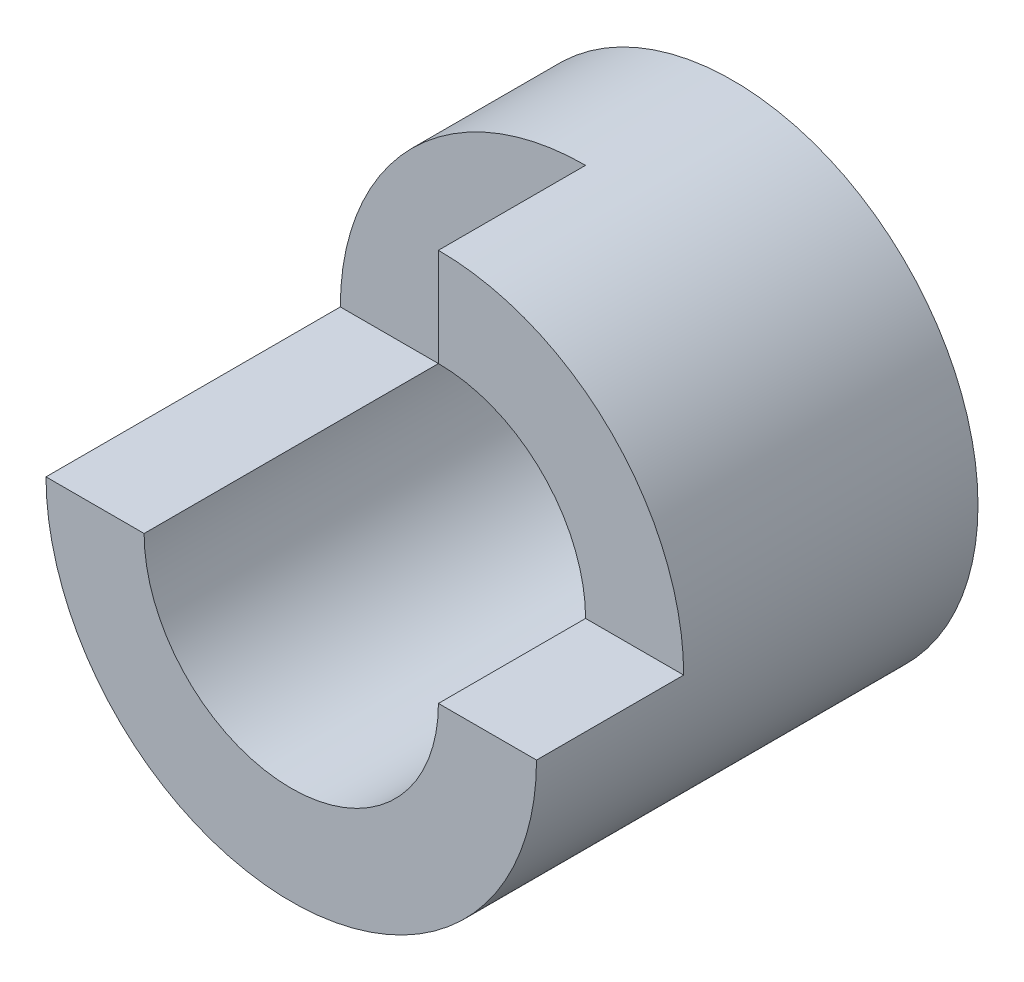
ISO-10303-21;
HEADER;
FILE_DESCRIPTION(('STEP AP214'),'2;1');
FILE_NAME('part.step','',(''),(''),'','','');
FILE_SCHEMA(('AUTOMOTIVE_DESIGN { 1 0 10303 214 1 1 1 1 }'));
ENDSEC;
DATA;
#1=APPLICATION_CONTEXT('core data for automotive mechanical design processes');
#2=APPLICATION_PROTOCOL_DEFINITION('international standard','automotive_design',2000,#1);
#3=PRODUCT_CONTEXT('',#1,'mechanical');
#4=PRODUCT('Part','Part','',(#3));
#5=PRODUCT_RELATED_PRODUCT_CATEGORY('part','',(#4));
#6=PRODUCT_DEFINITION_FORMATION('','',#4);
#7=PRODUCT_DEFINITION_CONTEXT('part definition',#1,'design');
#8=PRODUCT_DEFINITION('design','',#6,#7);
#9=PRODUCT_DEFINITION_SHAPE('','',#8);
#10=(LENGTH_UNIT() NAMED_UNIT(*) SI_UNIT(.MILLI.,.METRE.));
#11=(NAMED_UNIT(*) PLANE_ANGLE_UNIT() SI_UNIT($,.RADIAN.));
#12=(NAMED_UNIT(*) SI_UNIT($,.STERADIAN.) SOLID_ANGLE_UNIT());
#13=UNCERTAINTY_MEASURE_WITH_UNIT(LENGTH_MEASURE(1.E-05),#10,'distance_accuracy_value','');
#14=(GEOMETRIC_REPRESENTATION_CONTEXT(3) GLOBAL_UNCERTAINTY_ASSIGNED_CONTEXT((#13)) GLOBAL_UNIT_ASSIGNED_CONTEXT((#10,
#11,#12)) REPRESENTATION_CONTEXT('',''));
#15=CARTESIAN_POINT('',(0.,0.,0.));
#16=DIRECTION('',(0.,0.,1.));
#17=DIRECTION('',(1.,0.,0.));
#18=AXIS2_PLACEMENT_3D('',#15,#16,#17);
#19=CARTESIAN_POINT('',(0.,0.,9.));
#20=DIRECTION('',(0.,0.,1.));
#21=DIRECTION('',(1.,0.,0.));
#22=AXIS2_PLACEMENT_3D('',#19,#20,#21);
#23=PLANE('',#22);
#24=CARTESIAN_POINT('',(0.,0.,9.));
#25=DIRECTION('',(0.,0.,1.));
#26=DIRECTION('',(1.,0.,0.));
#27=AXIS2_PLACEMENT_3D('',#24,#25,#26);
#28=CIRCLE('',#27,5.);
#29=CARTESIAN_POINT('',(-5.,0.,9.));
#30=VERTEX_POINT('',#29);
#31=CARTESIAN_POINT('',(5.,0.,9.));
#32=VERTEX_POINT('',#31);
#33=EDGE_CURVE('E110',#30,#32,#28,.T.);
#34=ORIENTED_EDGE('',*,*,#33,.T.);
#35=DIRECTION('',(-1.,0.,0.));
#36=VECTOR('',#35,1.);
#37=CARTESIAN_POINT('',(0.,0.,9.));
#38=LINE('',#37,#36);
#39=CARTESIAN_POINT('',(3.,0.,9.));
#40=VERTEX_POINT('',#39);
#41=EDGE_CURVE('E111',#32,#40,#38,.T.);
#42=ORIENTED_EDGE('',*,*,#41,.T.);
#43=CARTESIAN_POINT('',(0.,0.,9.));
#44=DIRECTION('',(0.,0.,1.));
#45=DIRECTION('',(1.,0.,0.));
#46=AXIS2_PLACEMENT_3D('',#43,#44,#45);
#47=CIRCLE('',#46,3.);
#48=CARTESIAN_POINT('',(-3.,0.,9.));
#49=VERTEX_POINT('',#48);
#50=EDGE_CURVE('E123',#49,#40,#47,.T.);
#51=ORIENTED_EDGE('',*,*,#50,.F.);
#52=EDGE_CURVE('E48',#49,#30,#38,.T.);
#53=ORIENTED_EDGE('',*,*,#52,.T.);
#54=EDGE_LOOP('',(#34,#42,#51,#53));
#55=FACE_BOUND('',#54,.T.);
#56=ADVANCED_FACE('F33',(#55),#23,.T.);
#57=CARTESIAN_POINT('',(0.,0.,9.));
#58=DIRECTION('',(0.,0.,-1.));
#59=DIRECTION('',(-1.,0.,0.));
#60=AXIS2_PLACEMENT_3D('',#57,#58,#59);
#61=CYLINDRICAL_SURFACE('',#60,5.);
#62=DIRECTION('',(0.,0.,-1.));
#63=VECTOR('',#62,1.);
#64=CARTESIAN_POINT('',(-5.,0.,9.));
#65=LINE('',#64,#63);
#66=CARTESIAN_POINT('',(-5.,0.,3.));
#67=VERTEX_POINT('',#66);
#68=EDGE_CURVE('E102',#67,#30,#65,.F.);
#69=ORIENTED_EDGE('',*,*,#68,.F.);
#70=CARTESIAN_POINT('',(0.,0.,3.));
#71=DIRECTION('',(0.,0.,1.));
#72=DIRECTION('',(1.,0.,0.));
#73=AXIS2_PLACEMENT_3D('',#70,#71,#72);
#74=CIRCLE('',#73,5.);
#75=CARTESIAN_POINT('',(0.,5.,3.));
#76=VERTEX_POINT('',#75);
#77=EDGE_CURVE('E89',#76,#67,#74,.T.);
#78=ORIENTED_EDGE('',*,*,#77,.F.);
#79=DIRECTION('',(0.,0.,-1.));
#80=VECTOR('',#79,1.);
#81=CARTESIAN_POINT('',(0.,5.,9.));
#82=LINE('',#81,#80);
#83=CARTESIAN_POINT('',(0.,5.,6.));
#84=VERTEX_POINT('',#83);
#85=EDGE_CURVE('E98',#84,#76,#82,.T.);
#86=ORIENTED_EDGE('',*,*,#85,.F.);
#87=CARTESIAN_POINT('',(0.,0.,6.));
#88=DIRECTION('',(0.,0.,1.));
#89=DIRECTION('',(1.,0.,0.));
#90=AXIS2_PLACEMENT_3D('',#87,#88,#89);
#91=CIRCLE('',#90,5.);
#92=CARTESIAN_POINT('',(5.,0.,6.));
#93=VERTEX_POINT('',#92);
#94=EDGE_CURVE('E120',#93,#84,#91,.T.);
#95=ORIENTED_EDGE('',*,*,#94,.F.);
#96=DIRECTION('',(0.,0.,-1.));
#97=VECTOR('',#96,1.);
#98=CARTESIAN_POINT('',(5.,0.,9.));
#99=LINE('',#98,#97);
#100=EDGE_CURVE('E99',#32,#93,#99,.T.);
#101=ORIENTED_EDGE('',*,*,#100,.F.);
#102=ORIENTED_EDGE('',*,*,#33,.F.);
#103=EDGE_LOOP('',(#69,#78,#86,#95,#101,#102));
#104=FACE_BOUND('',#103,.T.);
#105=CARTESIAN_POINT('',(0.,0.,0.));
#106=DIRECTION('',(0.,0.,1.));
#107=DIRECTION('',(1.,0.,0.));
#108=AXIS2_PLACEMENT_3D('',#105,#106,#107);
#109=CIRCLE('',#108,5.);
#110=CARTESIAN_POINT('',(5.,0.,0.));
#111=VERTEX_POINT('',#110);
#112=EDGE_CURVE('E126',#111,#111,#109,.T.);
#113=ORIENTED_EDGE('',*,*,#112,.T.);
#114=EDGE_LOOP('',(#113));
#115=FACE_BOUND('',#114,.T.);
#116=ADVANCED_FACE('F35',(#104,#115),#61,.T.);
#117=CARTESIAN_POINT('',(0.,0.,9.));
#118=DIRECTION('',(0.,0.,-1.));
#119=DIRECTION('',(-1.,0.,0.));
#120=AXIS2_PLACEMENT_3D('',#117,#118,#119);
#121=CYLINDRICAL_SURFACE('',#120,3.);
#122=CARTESIAN_POINT('',(0.,0.,0.));
#123=DIRECTION('',(0.,0.,1.));
#124=DIRECTION('',(1.,0.,0.));
#125=AXIS2_PLACEMENT_3D('',#122,#123,#124);
#126=CIRCLE('',#125,3.);
#127=CARTESIAN_POINT('',(3.,0.,0.));
#128=VERTEX_POINT('',#127);
#129=EDGE_CURVE('E122',#128,#128,#126,.T.);
#130=ORIENTED_EDGE('',*,*,#129,.F.);
#131=EDGE_LOOP('',(#130));
#132=FACE_BOUND('',#131,.T.);
#133=ORIENTED_EDGE('',*,*,#50,.T.);
#134=DIRECTION('',(0.,0.,-1.));
#135=VECTOR('',#134,1.);
#136=CARTESIAN_POINT('',(3.,0.,9.));
#137=LINE('',#136,#135);
#138=CARTESIAN_POINT('',(3.,0.,6.));
#139=VERTEX_POINT('',#138);
#140=EDGE_CURVE('E11',#40,#139,#137,.T.);
#141=ORIENTED_EDGE('',*,*,#140,.T.);
#142=CARTESIAN_POINT('',(0.,0.,6.));
#143=DIRECTION('',(0.,0.,1.));
#144=DIRECTION('',(1.,0.,0.));
#145=AXIS2_PLACEMENT_3D('',#142,#143,#144);
#146=CIRCLE('',#145,3.);
#147=CARTESIAN_POINT('',(0.,3.,6.));
#148=VERTEX_POINT('',#147);
#149=EDGE_CURVE('E41',#139,#148,#146,.T.);
#150=ORIENTED_EDGE('',*,*,#149,.T.);
#151=DIRECTION('',(0.,0.,-1.));
#152=VECTOR('',#151,1.);
#153=CARTESIAN_POINT('',(0.,3.,9.));
#154=LINE('',#153,#152);
#155=CARTESIAN_POINT('',(0.,3.,3.));
#156=VERTEX_POINT('',#155);
#157=EDGE_CURVE('E56',#148,#156,#154,.T.);
#158=ORIENTED_EDGE('',*,*,#157,.T.);
#159=CARTESIAN_POINT('',(0.,0.,3.));
#160=DIRECTION('',(0.,0.,1.));
#161=DIRECTION('',(1.,0.,0.));
#162=AXIS2_PLACEMENT_3D('',#159,#160,#161);
#163=CIRCLE('',#162,3.);
#164=CARTESIAN_POINT('',(-3.,0.,3.));
#165=VERTEX_POINT('',#164);
#166=EDGE_CURVE('E133',#156,#165,#163,.T.);
#167=ORIENTED_EDGE('',*,*,#166,.T.);
#168=DIRECTION('',(0.,0.,-1.));
#169=VECTOR('',#168,1.);
#170=CARTESIAN_POINT('',(-3.,0.,9.));
#171=LINE('',#170,#169);
#172=EDGE_CURVE('E103',#165,#49,#171,.F.);
#173=ORIENTED_EDGE('',*,*,#172,.T.);
#174=EDGE_LOOP('',(#133,#141,#150,#158,#167,#173));
#175=FACE_BOUND('',#174,.T.);
#176=ADVANCED_FACE('F137',(#132,#175),#121,.F.);
#177=CARTESIAN_POINT('',(0.,0.,0.));
#178=DIRECTION('',(0.,0.,1.));
#179=DIRECTION('',(1.,0.,0.));
#180=AXIS2_PLACEMENT_3D('',#177,#178,#179);
#181=PLANE('',#180);
#182=ORIENTED_EDGE('',*,*,#112,.F.);
#183=EDGE_LOOP('',(#182));
#184=FACE_BOUND('',#183,.T.);
#185=ORIENTED_EDGE('',*,*,#129,.T.);
#186=EDGE_LOOP('',(#185));
#187=FACE_BOUND('',#186,.T.);
#188=ADVANCED_FACE('F157',(#184,#187),#181,.F.);
#189=CARTESIAN_POINT('',(0.,9.,6.));
#190=DIRECTION('',(0.,0.,1.));
#191=DIRECTION('',(1.,0.,0.));
#192=AXIS2_PLACEMENT_3D('',#189,#190,#191);
#193=PLANE('',#192);
#194=ORIENTED_EDGE('',*,*,#94,.T.);
#195=DIRECTION('',(0.,-1.,0.));
#196=VECTOR('',#195,1.);
#197=CARTESIAN_POINT('',(0.,9.,6.));
#198=LINE('',#197,#196);
#199=EDGE_CURVE('E115',#84,#148,#198,.T.);
#200=ORIENTED_EDGE('',*,*,#199,.T.);
#201=ORIENTED_EDGE('',*,*,#149,.F.);
#202=DIRECTION('',(-1.,0.,0.));
#203=VECTOR('',#202,1.);
#204=CARTESIAN_POINT('',(0.,0.,6.));
#205=LINE('',#204,#203);
#206=EDGE_CURVE('E104',#93,#139,#205,.T.);
#207=ORIENTED_EDGE('',*,*,#206,.F.);
#208=EDGE_LOOP('',(#194,#200,#201,#207));
#209=FACE_BOUND('',#208,.T.);
#210=ADVANCED_FACE('F141',(#209),#193,.T.);
#211=CARTESIAN_POINT('',(0.,9.,3.));
#212=DIRECTION('',(-1.,0.,0.));
#213=DIRECTION('',(0.,0.,1.));
#214=AXIS2_PLACEMENT_3D('',#211,#212,#213);
#215=PLANE('',#214);
#216=ORIENTED_EDGE('',*,*,#85,.T.);
#217=DIRECTION('',(0.,-1.,0.));
#218=VECTOR('',#217,1.);
#219=CARTESIAN_POINT('',(0.,9.,3.));
#220=LINE('',#219,#218);
#221=EDGE_CURVE('E94',#76,#156,#220,.T.);
#222=ORIENTED_EDGE('',*,*,#221,.T.);
#223=ORIENTED_EDGE('',*,*,#157,.F.);
#224=ORIENTED_EDGE('',*,*,#199,.F.);
#225=EDGE_LOOP('',(#216,#222,#223,#224));
#226=FACE_BOUND('',#225,.T.);
#227=ADVANCED_FACE('F147',(#226),#215,.T.);
#228=CARTESIAN_POINT('',(-5.,9.,3.));
#229=DIRECTION('',(0.,0.,1.));
#230=DIRECTION('',(1.,0.,0.));
#231=AXIS2_PLACEMENT_3D('',#228,#229,#230);
#232=PLANE('',#231);
#233=ORIENTED_EDGE('',*,*,#77,.T.);
#234=DIRECTION('',(-1.,0.,0.));
#235=VECTOR('',#234,1.);
#236=CARTESIAN_POINT('',(-5.,0.,3.));
#237=LINE('',#236,#235);
#238=EDGE_CURVE('E92',#165,#67,#237,.T.);
#239=ORIENTED_EDGE('',*,*,#238,.F.);
#240=ORIENTED_EDGE('',*,*,#166,.F.);
#241=ORIENTED_EDGE('',*,*,#221,.F.);
#242=EDGE_LOOP('',(#233,#239,#240,#241));
#243=FACE_BOUND('',#242,.T.);
#244=ADVANCED_FACE('F91',(#243),#232,.T.);
#245=CARTESIAN_POINT('',(0.,0.,0.));
#246=DIRECTION('',(0.,1.,0.));
#247=DIRECTION('',(0.,0.,1.));
#248=AXIS2_PLACEMENT_3D('',#245,#246,#247);
#249=PLANE('',#248);
#250=ORIENTED_EDGE('',*,*,#100,.T.);
#251=ORIENTED_EDGE('',*,*,#206,.T.);
#252=ORIENTED_EDGE('',*,*,#140,.F.);
#253=ORIENTED_EDGE('',*,*,#41,.F.);
#254=EDGE_LOOP('',(#250,#251,#252,#253));
#255=FACE_BOUND('',#254,.T.);
#256=ADVANCED_FACE('F144',(#255),#249,.T.);
#257=ORIENTED_EDGE('',*,*,#68,.T.);
#258=ORIENTED_EDGE('',*,*,#52,.F.);
#259=ORIENTED_EDGE('',*,*,#172,.F.);
#260=ORIENTED_EDGE('',*,*,#238,.T.);
#261=EDGE_LOOP('',(#257,#258,#259,#260));
#262=FACE_BOUND('',#261,.T.);
#263=ADVANCED_FACE('F101',(#262),#249,.T.);
#264=CLOSED_SHELL('',(#56,#116,#176,#188,#210,#227,#244,#256,#263));
#265=MANIFOLD_SOLID_BREP('B2',#264);
#266=ADVANCED_BREP_SHAPE_REPRESENTATION('',(#18,#265),#14);
#267=SHAPE_DEFINITION_REPRESENTATION(#9,#266);
ENDSEC;
END-ISO-10303-21;
